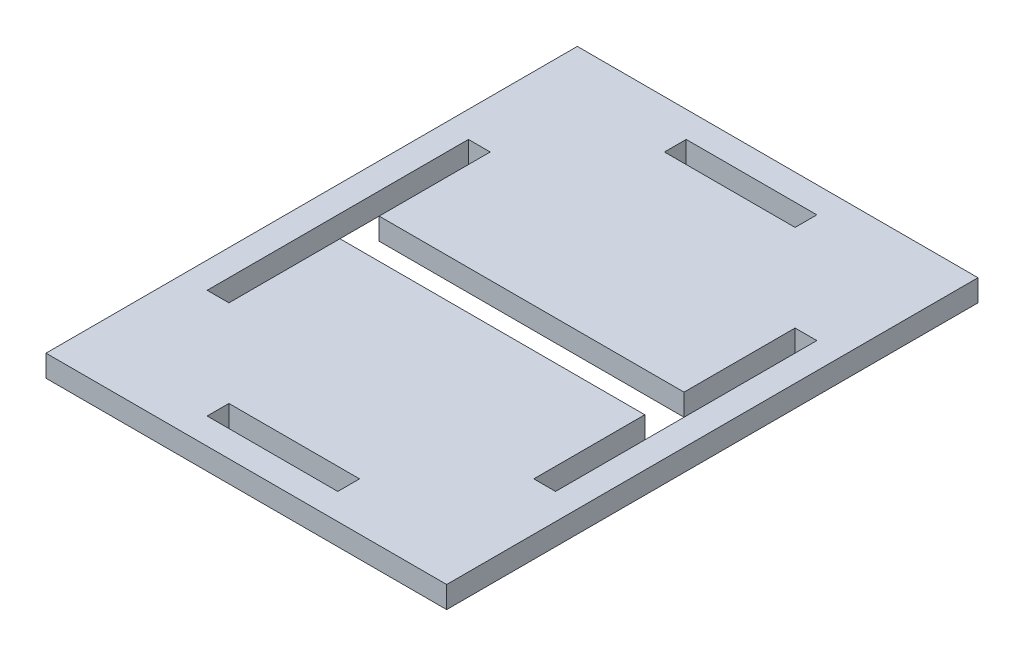
ISO-10303-21;
HEADER;
FILE_DESCRIPTION(('STEP AP214'),'2;1');
FILE_NAME('part.step','',(''),(''),'','','');
FILE_SCHEMA(('AUTOMOTIVE_DESIGN { 1 0 10303 214 1 1 1 1 }'));
ENDSEC;
DATA;
#1=APPLICATION_CONTEXT('core data for automotive mechanical design processes');
#2=APPLICATION_PROTOCOL_DEFINITION('international standard','automotive_design',2000,#1);
#3=PRODUCT_CONTEXT('',#1,'mechanical');
#4=PRODUCT('Part','Part','',(#3));
#5=PRODUCT_RELATED_PRODUCT_CATEGORY('part','',(#4));
#6=PRODUCT_DEFINITION_FORMATION('','',#4);
#7=PRODUCT_DEFINITION_CONTEXT('part definition',#1,'design');
#8=PRODUCT_DEFINITION('design','',#6,#7);
#9=PRODUCT_DEFINITION_SHAPE('','',#8);
#10=(LENGTH_UNIT() NAMED_UNIT(*) SI_UNIT(.MILLI.,.METRE.));
#11=(NAMED_UNIT(*) PLANE_ANGLE_UNIT() SI_UNIT($,.RADIAN.));
#12=(NAMED_UNIT(*) SI_UNIT($,.STERADIAN.) SOLID_ANGLE_UNIT());
#13=UNCERTAINTY_MEASURE_WITH_UNIT(LENGTH_MEASURE(1.E-05),#10,'distance_accuracy_value','');
#14=(GEOMETRIC_REPRESENTATION_CONTEXT(3) GLOBAL_UNCERTAINTY_ASSIGNED_CONTEXT((#13)) GLOBAL_UNIT_ASSIGNED_CONTEXT((#10,
#11,#12)) REPRESENTATION_CONTEXT('',''));
#15=CARTESIAN_POINT('',(0.,0.,0.));
#16=DIRECTION('',(0.,0.,1.));
#17=DIRECTION('',(1.,0.,0.));
#18=AXIS2_PLACEMENT_3D('',#15,#16,#17);
#19=CARTESIAN_POINT('',(35.,0.,-30.));
#20=DIRECTION('',(-1.,0.,0.));
#21=DIRECTION('',(0.,0.,1.));
#22=AXIS2_PLACEMENT_3D('',#19,#20,#21);
#23=PLANE('',#22);
#24=DIRECTION('',(0.,0.,1.));
#25=VECTOR('',#24,1.);
#26=CARTESIAN_POINT('',(35.,0.,-30.));
#27=LINE('',#26,#25);
#28=CARTESIAN_POINT('',(35.,0.,4.5));
#29=VERTEX_POINT('',#28);
#30=CARTESIAN_POINT('',(35.,0.,30.));
#31=VERTEX_POINT('',#30);
#32=EDGE_CURVE('E382',#29,#31,#27,.T.);
#33=ORIENTED_EDGE('',*,*,#32,.F.);
#34=DIRECTION('',(0.,1.,0.));
#35=VECTOR('',#34,1.);
#36=CARTESIAN_POINT('',(35.,-5.,4.5));
#37=LINE('',#36,#35);
#38=CARTESIAN_POINT('',(35.,5.,4.5));
#39=VERTEX_POINT('',#38);
#40=EDGE_CURVE('E198',#29,#39,#37,.T.);
#41=ORIENTED_EDGE('',*,*,#40,.T.);
#42=DIRECTION('',(0.,0.,1.));
#43=VECTOR('',#42,1.);
#44=CARTESIAN_POINT('',(35.,5.,-30.));
#45=LINE('',#44,#43);
#46=CARTESIAN_POINT('',(35.,5.,30.));
#47=VERTEX_POINT('',#46);
#48=EDGE_CURVE('E217',#39,#47,#45,.T.);
#49=ORIENTED_EDGE('',*,*,#48,.T.);
#50=DIRECTION('',(0.,1.,0.));
#51=VECTOR('',#50,1.);
#52=CARTESIAN_POINT('',(35.,0.,30.));
#53=LINE('',#52,#51);
#54=EDGE_CURVE('E229',#31,#47,#53,.T.);
#55=ORIENTED_EDGE('',*,*,#54,.F.);
#56=EDGE_LOOP('',(#33,#41,#49,#55));
#57=FACE_BOUND('',#56,.T.);
#58=ADVANCED_FACE('F33',(#57),#23,.F.);
#59=CARTESIAN_POINT('',(-35.,0.,-30.));
#60=DIRECTION('',(1.,0.,0.));
#61=DIRECTION('',(0.,0.,-1.));
#62=AXIS2_PLACEMENT_3D('',#59,#60,#61);
#63=PLANE('',#62);
#64=DIRECTION('',(0.,0.,-1.));
#65=VECTOR('',#64,1.);
#66=CARTESIAN_POINT('',(-35.,5.,-30.));
#67=LINE('',#66,#65);
#68=CARTESIAN_POINT('',(-35.,5.,30.));
#69=VERTEX_POINT('',#68);
#70=CARTESIAN_POINT('',(-35.,5.,4.5));
#71=VERTEX_POINT('',#70);
#72=EDGE_CURVE('E366',#69,#71,#67,.T.);
#73=ORIENTED_EDGE('',*,*,#72,.T.);
#74=DIRECTION('',(0.,-1.,0.));
#75=VECTOR('',#74,1.);
#76=CARTESIAN_POINT('',(-35.,0.,4.5));
#77=LINE('',#76,#75);
#78=CARTESIAN_POINT('',(-35.,0.,4.5));
#79=VERTEX_POINT('',#78);
#80=EDGE_CURVE('E11',#71,#79,#77,.T.);
#81=ORIENTED_EDGE('',*,*,#80,.T.);
#82=DIRECTION('',(0.,0.,-1.));
#83=VECTOR('',#82,1.);
#84=CARTESIAN_POINT('',(-35.,0.,-30.));
#85=LINE('',#84,#83);
#86=CARTESIAN_POINT('',(-35.,0.,30.));
#87=VERTEX_POINT('',#86);
#88=EDGE_CURVE('E357',#87,#79,#85,.T.);
#89=ORIENTED_EDGE('',*,*,#88,.F.);
#90=DIRECTION('',(0.,1.,0.));
#91=VECTOR('',#90,1.);
#92=CARTESIAN_POINT('',(-35.,0.,30.));
#93=LINE('',#92,#91);
#94=EDGE_CURVE('E374',#87,#69,#93,.T.);
#95=ORIENTED_EDGE('',*,*,#94,.T.);
#96=EDGE_LOOP('',(#73,#81,#89,#95));
#97=FACE_BOUND('',#96,.T.);
#98=ADVANCED_FACE('F403',(#97),#63,.F.);
#99=CARTESIAN_POINT('',(46.,5.,-61.));
#100=DIRECTION('',(-1.,0.,0.));
#101=DIRECTION('',(0.,0.,1.));
#102=AXIS2_PLACEMENT_3D('',#99,#100,#101);
#103=PLANE('',#102);
#104=DIRECTION('',(0.,0.,-1.));
#105=VECTOR('',#104,1.);
#106=CARTESIAN_POINT('',(46.,0.,-61.));
#107=LINE('',#106,#105);
#108=CARTESIAN_POINT('',(46.,0.,61.));
#109=VERTEX_POINT('',#108);
#110=CARTESIAN_POINT('',(46.,0.,-61.));
#111=VERTEX_POINT('',#110);
#112=EDGE_CURVE('E313',#109,#111,#107,.T.);
#113=ORIENTED_EDGE('',*,*,#112,.T.);
#114=DIRECTION('',(0.,-1.,0.));
#115=VECTOR('',#114,1.);
#116=CARTESIAN_POINT('',(46.,5.,-61.));
#117=LINE('',#116,#115);
#118=CARTESIAN_POINT('',(46.,5.,-61.));
#119=VERTEX_POINT('',#118);
#120=EDGE_CURVE('E330',#119,#111,#117,.T.);
#121=ORIENTED_EDGE('',*,*,#120,.F.);
#122=DIRECTION('',(0.,0.,-1.));
#123=VECTOR('',#122,1.);
#124=CARTESIAN_POINT('',(46.,5.,-61.));
#125=LINE('',#124,#123);
#126=CARTESIAN_POINT('',(46.,5.,61.));
#127=VERTEX_POINT('',#126);
#128=EDGE_CURVE('E302',#127,#119,#125,.T.);
#129=ORIENTED_EDGE('',*,*,#128,.F.);
#130=DIRECTION('',(0.,-1.,0.));
#131=VECTOR('',#130,1.);
#132=CARTESIAN_POINT('',(46.,5.,61.));
#133=LINE('',#132,#131);
#134=EDGE_CURVE('E312',#127,#109,#133,.T.);
#135=ORIENTED_EDGE('',*,*,#134,.T.);
#136=EDGE_LOOP('',(#113,#121,#129,#135));
#137=FACE_BOUND('',#136,.T.);
#138=ADVANCED_FACE('F35',(#137),#103,.F.);
#139=CARTESIAN_POINT('',(-46.,5.,-61.));
#140=DIRECTION('',(0.,0.,1.));
#141=DIRECTION('',(1.,0.,0.));
#142=AXIS2_PLACEMENT_3D('',#139,#140,#141);
#143=PLANE('',#142);
#144=DIRECTION('',(-1.,0.,0.));
#145=VECTOR('',#144,1.);
#146=CARTESIAN_POINT('',(-46.,0.,-61.));
#147=LINE('',#146,#145);
#148=CARTESIAN_POINT('',(-46.,0.,-61.));
#149=VERTEX_POINT('',#148);
#150=EDGE_CURVE('E316',#111,#149,#147,.T.);
#151=ORIENTED_EDGE('',*,*,#150,.T.);
#152=DIRECTION('',(0.,-1.,0.));
#153=VECTOR('',#152,1.);
#154=CARTESIAN_POINT('',(-46.,5.,-61.));
#155=LINE('',#154,#153);
#156=CARTESIAN_POINT('',(-46.,5.,-61.));
#157=VERTEX_POINT('',#156);
#158=EDGE_CURVE('E327',#157,#149,#155,.T.);
#159=ORIENTED_EDGE('',*,*,#158,.F.);
#160=DIRECTION('',(-1.,0.,0.));
#161=VECTOR('',#160,1.);
#162=CARTESIAN_POINT('',(-46.,5.,-61.));
#163=LINE('',#162,#161);
#164=EDGE_CURVE('E305',#119,#157,#163,.T.);
#165=ORIENTED_EDGE('',*,*,#164,.F.);
#166=ORIENTED_EDGE('',*,*,#120,.T.);
#167=EDGE_LOOP('',(#151,#159,#165,#166));
#168=FACE_BOUND('',#167,.T.);
#169=ADVANCED_FACE('F624',(#168),#143,.F.);
#170=CARTESIAN_POINT('',(-46.,5.,-61.));
#171=DIRECTION('',(1.,0.,0.));
#172=DIRECTION('',(0.,0.,-1.));
#173=AXIS2_PLACEMENT_3D('',#170,#171,#172);
#174=PLANE('',#173);
#175=DIRECTION('',(0.,0.,1.));
#176=VECTOR('',#175,1.);
#177=CARTESIAN_POINT('',(-46.,0.,-61.));
#178=LINE('',#177,#176);
#179=CARTESIAN_POINT('',(-46.,0.,61.));
#180=VERTEX_POINT('',#179);
#181=EDGE_CURVE('E319',#149,#180,#178,.T.);
#182=ORIENTED_EDGE('',*,*,#181,.T.);
#183=DIRECTION('',(0.,-1.,0.));
#184=VECTOR('',#183,1.);
#185=CARTESIAN_POINT('',(-46.,5.,61.));
#186=LINE('',#185,#184);
#187=CARTESIAN_POINT('',(-46.,5.,61.));
#188=VERTEX_POINT('',#187);
#189=EDGE_CURVE('E324',#188,#180,#186,.T.);
#190=ORIENTED_EDGE('',*,*,#189,.F.);
#191=DIRECTION('',(0.,0.,1.));
#192=VECTOR('',#191,1.);
#193=CARTESIAN_POINT('',(-46.,5.,-61.));
#194=LINE('',#193,#192);
#195=EDGE_CURVE('E308',#157,#188,#194,.T.);
#196=ORIENTED_EDGE('',*,*,#195,.F.);
#197=ORIENTED_EDGE('',*,*,#158,.T.);
#198=EDGE_LOOP('',(#182,#190,#196,#197));
#199=FACE_BOUND('',#198,.T.);
#200=ADVANCED_FACE('F614',(#199),#174,.F.);
#201=CARTESIAN_POINT('',(-46.,5.,61.));
#202=DIRECTION('',(0.,0.,-1.));
#203=DIRECTION('',(-1.,0.,0.));
#204=AXIS2_PLACEMENT_3D('',#201,#202,#203);
#205=PLANE('',#204);
#206=DIRECTION('',(1.,0.,0.));
#207=VECTOR('',#206,1.);
#208=CARTESIAN_POINT('',(-46.,0.,61.));
#209=LINE('',#208,#207);
#210=EDGE_CURVE('E306',#180,#109,#209,.T.);
#211=ORIENTED_EDGE('',*,*,#210,.T.);
#212=ORIENTED_EDGE('',*,*,#134,.F.);
#213=DIRECTION('',(1.,0.,0.));
#214=VECTOR('',#213,1.);
#215=CARTESIAN_POINT('',(-46.,5.,61.));
#216=LINE('',#215,#214);
#217=EDGE_CURVE('E310',#188,#127,#216,.T.);
#218=ORIENTED_EDGE('',*,*,#217,.F.);
#219=ORIENTED_EDGE('',*,*,#189,.T.);
#220=EDGE_LOOP('',(#211,#212,#218,#219));
#221=FACE_BOUND('',#220,.T.);
#222=ADVANCED_FACE('F493',(#221),#205,.F.);
#223=CARTESIAN_POINT('',(0.,5.,0.));
#224=DIRECTION('',(0.,1.,0.));
#225=DIRECTION('',(0.,0.,1.));
#226=AXIS2_PLACEMENT_3D('',#223,#224,#225);
#227=PLANE('',#226);
#228=DIRECTION('',(1.,0.,0.));
#229=VECTOR('',#228,1.);
#230=CARTESIAN_POINT('',(-35.,5.,4.5));
#231=LINE('',#230,#229);
#232=EDGE_CURVE('E199',#71,#39,#231,.T.);
#233=ORIENTED_EDGE('',*,*,#232,.F.);
#234=ORIENTED_EDGE('',*,*,#72,.F.);
#235=DIRECTION('',(1.,0.,0.));
#236=VECTOR('',#235,1.);
#237=CARTESIAN_POINT('',(-35.,5.,30.));
#238=LINE('',#237,#236);
#239=CARTESIAN_POINT('',(-40.,5.,30.));
#240=VERTEX_POINT('',#239);
#241=EDGE_CURVE('E363',#240,#69,#238,.T.);
#242=ORIENTED_EDGE('',*,*,#241,.F.);
#243=DIRECTION('',(0.,0.,1.));
#244=VECTOR('',#243,1.);
#245=CARTESIAN_POINT('',(-40.,5.,-30.));
#246=LINE('',#245,#244);
#247=CARTESIAN_POINT('',(-40.,5.,-30.));
#248=VERTEX_POINT('',#247);
#249=EDGE_CURVE('E228',#248,#240,#246,.T.);
#250=ORIENTED_EDGE('',*,*,#249,.F.);
#251=DIRECTION('',(-1.,0.,0.));
#252=VECTOR('',#251,1.);
#253=CARTESIAN_POINT('',(-35.,5.,-30.));
#254=LINE('',#253,#252);
#255=CARTESIAN_POINT('',(-35.,5.,-30.));
#256=VERTEX_POINT('',#255);
#257=EDGE_CURVE('E354',#256,#248,#254,.T.);
#258=ORIENTED_EDGE('',*,*,#257,.F.);
#259=CARTESIAN_POINT('',(-35.,5.,-4.5));
#260=VERTEX_POINT('',#259);
#261=EDGE_CURVE('E210',#260,#256,#67,.T.);
#262=ORIENTED_EDGE('',*,*,#261,.F.);
#263=DIRECTION('',(-1.,0.,0.));
#264=VECTOR('',#263,1.);
#265=CARTESIAN_POINT('',(-35.,5.,-4.5));
#266=LINE('',#265,#264);
#267=CARTESIAN_POINT('',(35.,5.,-4.5));
#268=VERTEX_POINT('',#267);
#269=EDGE_CURVE('E55',#268,#260,#266,.T.);
#270=ORIENTED_EDGE('',*,*,#269,.F.);
#271=CARTESIAN_POINT('',(35.,5.,-30.));
#272=VERTEX_POINT('',#271);
#273=EDGE_CURVE('E208',#272,#268,#45,.T.);
#274=ORIENTED_EDGE('',*,*,#273,.F.);
#275=DIRECTION('',(-1.,0.,0.));
#276=VECTOR('',#275,1.);
#277=CARTESIAN_POINT('',(35.,5.,-30.));
#278=LINE('',#277,#276);
#279=CARTESIAN_POINT('',(40.,5.,-30.));
#280=VERTEX_POINT('',#279);
#281=EDGE_CURVE('E222',#280,#272,#278,.T.);
#282=ORIENTED_EDGE('',*,*,#281,.F.);
#283=DIRECTION('',(0.,0.,-1.));
#284=VECTOR('',#283,1.);
#285=CARTESIAN_POINT('',(40.,5.,-30.));
#286=LINE('',#285,#284);
#287=CARTESIAN_POINT('',(40.,5.,30.));
#288=VERTEX_POINT('',#287);
#289=EDGE_CURVE('E264',#288,#280,#286,.T.);
#290=ORIENTED_EDGE('',*,*,#289,.F.);
#291=DIRECTION('',(1.,0.,0.));
#292=VECTOR('',#291,1.);
#293=CARTESIAN_POINT('',(35.,5.,30.));
#294=LINE('',#293,#292);
#295=EDGE_CURVE('E216',#47,#288,#294,.T.);
#296=ORIENTED_EDGE('',*,*,#295,.F.);
#297=ORIENTED_EDGE('',*,*,#48,.F.);
#298=EDGE_LOOP('',(#233,#234,#242,#250,#258,#262,#270,#274,#282,#290,#296,#297));
#299=FACE_BOUND('',#298,.T.);
#300=DIRECTION('',(0.,0.,-1.));
#301=VECTOR('',#300,1.);
#302=CARTESIAN_POINT('',(15.,5.,-50.));
#303=LINE('',#302,#301);
#304=CARTESIAN_POINT('',(15.,5.,-50.));
#305=VERTEX_POINT('',#304);
#306=CARTESIAN_POINT('',(15.,5.,-55.));
#307=VERTEX_POINT('',#306);
#308=EDGE_CURVE('E251',#305,#307,#303,.T.);
#309=ORIENTED_EDGE('',*,*,#308,.F.);
#310=DIRECTION('',(1.,0.,0.));
#311=VECTOR('',#310,1.);
#312=CARTESIAN_POINT('',(-15.,5.,-50.));
#313=LINE('',#312,#311);
#314=CARTESIAN_POINT('',(-15.,5.,-50.));
#315=VERTEX_POINT('',#314);
#316=EDGE_CURVE('E241',#315,#305,#313,.T.);
#317=ORIENTED_EDGE('',*,*,#316,.F.);
#318=DIRECTION('',(0.,0.,1.));
#319=VECTOR('',#318,1.);
#320=CARTESIAN_POINT('',(-15.,5.,-50.));
#321=LINE('',#320,#319);
#322=CARTESIAN_POINT('',(-15.,5.,-55.));
#323=VERTEX_POINT('',#322);
#324=EDGE_CURVE('E257',#323,#315,#321,.T.);
#325=ORIENTED_EDGE('',*,*,#324,.F.);
#326=DIRECTION('',(-1.,0.,0.));
#327=VECTOR('',#326,1.);
#328=CARTESIAN_POINT('',(-15.,5.,-55.));
#329=LINE('',#328,#327);
#330=EDGE_CURVE('E253',#307,#323,#329,.T.);
#331=ORIENTED_EDGE('',*,*,#330,.F.);
#332=EDGE_LOOP('',(#309,#317,#325,#331));
#333=FACE_BOUND('',#332,.T.);
#334=DIRECTION('',(0.,0.,-1.));
#335=VECTOR('',#334,1.);
#336=CARTESIAN_POINT('',(15.,5.,50.));
#337=LINE('',#336,#335);
#338=CARTESIAN_POINT('',(15.,5.,55.));
#339=VERTEX_POINT('',#338);
#340=CARTESIAN_POINT('',(15.,5.,50.));
#341=VERTEX_POINT('',#340);
#342=EDGE_CURVE('E285',#339,#341,#337,.T.);
#343=ORIENTED_EDGE('',*,*,#342,.F.);
#344=DIRECTION('',(1.,0.,0.));
#345=VECTOR('',#344,1.);
#346=CARTESIAN_POINT('',(-15.,5.,55.));
#347=LINE('',#346,#345);
#348=CARTESIAN_POINT('',(-15.,5.,55.));
#349=VERTEX_POINT('',#348);
#350=EDGE_CURVE('E275',#349,#339,#347,.T.);
#351=ORIENTED_EDGE('',*,*,#350,.F.);
#352=DIRECTION('',(0.,0.,1.));
#353=VECTOR('',#352,1.);
#354=CARTESIAN_POINT('',(-15.,5.,50.));
#355=LINE('',#354,#353);
#356=CARTESIAN_POINT('',(-15.,5.,50.));
#357=VERTEX_POINT('',#356);
#358=EDGE_CURVE('E290',#357,#349,#355,.T.);
#359=ORIENTED_EDGE('',*,*,#358,.F.);
#360=DIRECTION('',(-1.,0.,0.));
#361=VECTOR('',#360,1.);
#362=CARTESIAN_POINT('',(-15.,5.,50.));
#363=LINE('',#362,#361);
#364=EDGE_CURVE('E287',#341,#357,#363,.T.);
#365=ORIENTED_EDGE('',*,*,#364,.F.);
#366=EDGE_LOOP('',(#343,#351,#359,#365));
#367=FACE_BOUND('',#366,.T.);
#368=ORIENTED_EDGE('',*,*,#128,.T.);
#369=ORIENTED_EDGE('',*,*,#164,.T.);
#370=ORIENTED_EDGE('',*,*,#195,.T.);
#371=ORIENTED_EDGE('',*,*,#217,.T.);
#372=EDGE_LOOP('',(#368,#369,#370,#371));
#373=FACE_BOUND('',#372,.T.);
#374=ADVANCED_FACE('F205',(#299,#333,#367,#373),#227,.T.);
#375=CARTESIAN_POINT('',(0.,0.,0.));
#376=DIRECTION('',(0.,1.,0.));
#377=DIRECTION('',(0.,0.,1.));
#378=AXIS2_PLACEMENT_3D('',#375,#376,#377);
#379=PLANE('',#378);
#380=ORIENTED_EDGE('',*,*,#88,.T.);
#381=DIRECTION('',(1.,0.,0.));
#382=VECTOR('',#381,1.);
#383=CARTESIAN_POINT('',(0.,0.,4.5));
#384=LINE('',#383,#382);
#385=EDGE_CURVE('E48',#79,#29,#384,.T.);
#386=ORIENTED_EDGE('',*,*,#385,.T.);
#387=ORIENTED_EDGE('',*,*,#32,.T.);
#388=DIRECTION('',(1.,0.,0.));
#389=VECTOR('',#388,1.);
#390=CARTESIAN_POINT('',(35.,0.,30.));
#391=LINE('',#390,#389);
#392=CARTESIAN_POINT('',(40.,0.,30.));
#393=VERTEX_POINT('',#392);
#394=EDGE_CURVE('E236',#31,#393,#391,.T.);
#395=ORIENTED_EDGE('',*,*,#394,.T.);
#396=DIRECTION('',(0.,0.,-1.));
#397=VECTOR('',#396,1.);
#398=CARTESIAN_POINT('',(40.,0.,-30.));
#399=LINE('',#398,#397);
#400=CARTESIAN_POINT('',(40.,0.,-30.));
#401=VERTEX_POINT('',#400);
#402=EDGE_CURVE('E220',#393,#401,#399,.T.);
#403=ORIENTED_EDGE('',*,*,#402,.T.);
#404=DIRECTION('',(-1.,0.,0.));
#405=VECTOR('',#404,1.);
#406=CARTESIAN_POINT('',(35.,0.,-30.));
#407=LINE('',#406,#405);
#408=CARTESIAN_POINT('',(35.,0.,-30.));
#409=VERTEX_POINT('',#408);
#410=EDGE_CURVE('E380',#401,#409,#407,.T.);
#411=ORIENTED_EDGE('',*,*,#410,.T.);
#412=CARTESIAN_POINT('',(35.,0.,-4.5));
#413=VERTEX_POINT('',#412);
#414=EDGE_CURVE('E344',#409,#413,#27,.T.);
#415=ORIENTED_EDGE('',*,*,#414,.T.);
#416=DIRECTION('',(-1.,0.,0.));
#417=VECTOR('',#416,1.);
#418=CARTESIAN_POINT('',(0.,0.,-4.5));
#419=LINE('',#418,#417);
#420=CARTESIAN_POINT('',(-35.,0.,-4.5));
#421=VERTEX_POINT('',#420);
#422=EDGE_CURVE('E194',#413,#421,#419,.T.);
#423=ORIENTED_EDGE('',*,*,#422,.T.);
#424=CARTESIAN_POINT('',(-35.,0.,-30.));
#425=VERTEX_POINT('',#424);
#426=EDGE_CURVE('E337',#421,#425,#85,.T.);
#427=ORIENTED_EDGE('',*,*,#426,.T.);
#428=DIRECTION('',(-1.,0.,0.));
#429=VECTOR('',#428,1.);
#430=CARTESIAN_POINT('',(-35.,0.,-30.));
#431=LINE('',#430,#429);
#432=CARTESIAN_POINT('',(-40.,0.,-30.));
#433=VERTEX_POINT('',#432);
#434=EDGE_CURVE('E359',#425,#433,#431,.T.);
#435=ORIENTED_EDGE('',*,*,#434,.T.);
#436=DIRECTION('',(0.,0.,1.));
#437=VECTOR('',#436,1.);
#438=CARTESIAN_POINT('',(-40.,0.,-30.));
#439=LINE('',#438,#437);
#440=CARTESIAN_POINT('',(-40.,0.,30.));
#441=VERTEX_POINT('',#440);
#442=EDGE_CURVE('E350',#433,#441,#439,.T.);
#443=ORIENTED_EDGE('',*,*,#442,.T.);
#444=DIRECTION('',(1.,0.,0.));
#445=VECTOR('',#444,1.);
#446=CARTESIAN_POINT('',(-35.,0.,30.));
#447=LINE('',#446,#445);
#448=EDGE_CURVE('E353',#441,#87,#447,.T.);
#449=ORIENTED_EDGE('',*,*,#448,.T.);
#450=EDGE_LOOP('',(#380,#386,#387,#395,#403,#411,#415,#423,#427,#435,#443,#449));
#451=FACE_BOUND('',#450,.T.);
#452=DIRECTION('',(1.,0.,0.));
#453=VECTOR('',#452,1.);
#454=CARTESIAN_POINT('',(-15.,0.,-50.));
#455=LINE('',#454,#453);
#456=CARTESIAN_POINT('',(-15.,0.,-50.));
#457=VERTEX_POINT('',#456);
#458=CARTESIAN_POINT('',(15.,0.,-50.));
#459=VERTEX_POINT('',#458);
#460=EDGE_CURVE('E247',#457,#459,#455,.T.);
#461=ORIENTED_EDGE('',*,*,#460,.T.);
#462=DIRECTION('',(0.,0.,-1.));
#463=VECTOR('',#462,1.);
#464=CARTESIAN_POINT('',(15.,0.,-50.));
#465=LINE('',#464,#463);
#466=CARTESIAN_POINT('',(15.,0.,-55.));
#467=VERTEX_POINT('',#466);
#468=EDGE_CURVE('E237',#459,#467,#465,.T.);
#469=ORIENTED_EDGE('',*,*,#468,.T.);
#470=DIRECTION('',(-1.,0.,0.));
#471=VECTOR('',#470,1.);
#472=CARTESIAN_POINT('',(-15.,0.,-55.));
#473=LINE('',#472,#471);
#474=CARTESIAN_POINT('',(-15.,0.,-55.));
#475=VERTEX_POINT('',#474);
#476=EDGE_CURVE('E240',#467,#475,#473,.T.);
#477=ORIENTED_EDGE('',*,*,#476,.T.);
#478=DIRECTION('',(0.,0.,1.));
#479=VECTOR('',#478,1.);
#480=CARTESIAN_POINT('',(-15.,0.,-50.));
#481=LINE('',#480,#479);
#482=EDGE_CURVE('E244',#475,#457,#481,.T.);
#483=ORIENTED_EDGE('',*,*,#482,.T.);
#484=EDGE_LOOP('',(#461,#469,#477,#483));
#485=FACE_BOUND('',#484,.T.);
#486=DIRECTION('',(1.,0.,0.));
#487=VECTOR('',#486,1.);
#488=CARTESIAN_POINT('',(-15.,0.,55.));
#489=LINE('',#488,#487);
#490=CARTESIAN_POINT('',(-15.,0.,55.));
#491=VERTEX_POINT('',#490);
#492=CARTESIAN_POINT('',(15.,0.,55.));
#493=VERTEX_POINT('',#492);
#494=EDGE_CURVE('E281',#491,#493,#489,.T.);
#495=ORIENTED_EDGE('',*,*,#494,.T.);
#496=DIRECTION('',(0.,0.,-1.));
#497=VECTOR('',#496,1.);
#498=CARTESIAN_POINT('',(15.,0.,50.));
#499=LINE('',#498,#497);
#500=CARTESIAN_POINT('',(15.,0.,50.));
#501=VERTEX_POINT('',#500);
#502=EDGE_CURVE('E271',#493,#501,#499,.T.);
#503=ORIENTED_EDGE('',*,*,#502,.T.);
#504=DIRECTION('',(-1.,0.,0.));
#505=VECTOR('',#504,1.);
#506=CARTESIAN_POINT('',(-15.,0.,50.));
#507=LINE('',#506,#505);
#508=CARTESIAN_POINT('',(-15.,0.,50.));
#509=VERTEX_POINT('',#508);
#510=EDGE_CURVE('E274',#501,#509,#507,.T.);
#511=ORIENTED_EDGE('',*,*,#510,.T.);
#512=DIRECTION('',(0.,0.,1.));
#513=VECTOR('',#512,1.);
#514=CARTESIAN_POINT('',(-15.,0.,50.));
#515=LINE('',#514,#513);
#516=EDGE_CURVE('E278',#509,#491,#515,.T.);
#517=ORIENTED_EDGE('',*,*,#516,.T.);
#518=EDGE_LOOP('',(#495,#503,#511,#517));
#519=FACE_BOUND('',#518,.T.);
#520=ORIENTED_EDGE('',*,*,#112,.F.);
#521=ORIENTED_EDGE('',*,*,#210,.F.);
#522=ORIENTED_EDGE('',*,*,#181,.F.);
#523=ORIENTED_EDGE('',*,*,#150,.F.);
#524=EDGE_LOOP('',(#520,#521,#522,#523));
#525=FACE_BOUND('',#524,.T.);
#526=ADVANCED_FACE('F340',(#451,#485,#519,#525),#379,.F.);
#527=CARTESIAN_POINT('',(15.,0.,50.));
#528=DIRECTION('',(1.,0.,0.));
#529=DIRECTION('',(0.,0.,-1.));
#530=AXIS2_PLACEMENT_3D('',#527,#528,#529);
#531=PLANE('',#530);
#532=ORIENTED_EDGE('',*,*,#342,.T.);
#533=DIRECTION('',(0.,1.,0.));
#534=VECTOR('',#533,1.);
#535=CARTESIAN_POINT('',(15.,0.,50.));
#536=LINE('',#535,#534);
#537=EDGE_CURVE('E284',#501,#341,#536,.T.);
#538=ORIENTED_EDGE('',*,*,#537,.F.);
#539=ORIENTED_EDGE('',*,*,#502,.F.);
#540=DIRECTION('',(0.,1.,0.));
#541=VECTOR('',#540,1.);
#542=CARTESIAN_POINT('',(15.,0.,55.));
#543=LINE('',#542,#541);
#544=EDGE_CURVE('E254',#493,#339,#543,.T.);
#545=ORIENTED_EDGE('',*,*,#544,.T.);
#546=EDGE_LOOP('',(#532,#538,#539,#545));
#547=FACE_BOUND('',#546,.T.);
#548=ADVANCED_FACE('F482',(#547),#531,.F.);
#549=CARTESIAN_POINT('',(-15.,0.,55.));
#550=DIRECTION('',(0.,0.,1.));
#551=DIRECTION('',(1.,0.,0.));
#552=AXIS2_PLACEMENT_3D('',#549,#550,#551);
#553=PLANE('',#552);
#554=ORIENTED_EDGE('',*,*,#350,.T.);
#555=ORIENTED_EDGE('',*,*,#544,.F.);
#556=ORIENTED_EDGE('',*,*,#494,.F.);
#557=DIRECTION('',(0.,1.,0.));
#558=VECTOR('',#557,1.);
#559=CARTESIAN_POINT('',(-15.,0.,55.));
#560=LINE('',#559,#558);
#561=EDGE_CURVE('E296',#491,#349,#560,.T.);
#562=ORIENTED_EDGE('',*,*,#561,.T.);
#563=EDGE_LOOP('',(#554,#555,#556,#562));
#564=FACE_BOUND('',#563,.T.);
#565=ADVANCED_FACE('F590',(#564),#553,.F.);
#566=CARTESIAN_POINT('',(-15.,0.,50.));
#567=DIRECTION('',(-1.,0.,0.));
#568=DIRECTION('',(0.,0.,1.));
#569=AXIS2_PLACEMENT_3D('',#566,#567,#568);
#570=PLANE('',#569);
#571=ORIENTED_EDGE('',*,*,#358,.T.);
#572=ORIENTED_EDGE('',*,*,#561,.F.);
#573=ORIENTED_EDGE('',*,*,#516,.F.);
#574=DIRECTION('',(0.,1.,0.));
#575=VECTOR('',#574,1.);
#576=CARTESIAN_POINT('',(-15.,0.,50.));
#577=LINE('',#576,#575);
#578=EDGE_CURVE('E298',#509,#357,#577,.T.);
#579=ORIENTED_EDGE('',*,*,#578,.T.);
#580=EDGE_LOOP('',(#571,#572,#573,#579));
#581=FACE_BOUND('',#580,.T.);
#582=ADVANCED_FACE('F580',(#581),#570,.F.);
#583=CARTESIAN_POINT('',(-15.,0.,50.));
#584=DIRECTION('',(0.,0.,-1.));
#585=DIRECTION('',(-1.,0.,0.));
#586=AXIS2_PLACEMENT_3D('',#583,#584,#585);
#587=PLANE('',#586);
#588=ORIENTED_EDGE('',*,*,#364,.T.);
#589=ORIENTED_EDGE('',*,*,#578,.F.);
#590=ORIENTED_EDGE('',*,*,#510,.F.);
#591=ORIENTED_EDGE('',*,*,#537,.T.);
#592=EDGE_LOOP('',(#588,#589,#590,#591));
#593=FACE_BOUND('',#592,.T.);
#594=ADVANCED_FACE('F570',(#593),#587,.F.);
#595=CARTESIAN_POINT('',(15.,0.,-50.));
#596=DIRECTION('',(1.,0.,0.));
#597=DIRECTION('',(0.,0.,-1.));
#598=AXIS2_PLACEMENT_3D('',#595,#596,#597);
#599=PLANE('',#598);
#600=ORIENTED_EDGE('',*,*,#308,.T.);
#601=DIRECTION('',(0.,1.,0.));
#602=VECTOR('',#601,1.);
#603=CARTESIAN_POINT('',(15.,0.,-55.));
#604=LINE('',#603,#602);
#605=EDGE_CURVE('E250',#467,#307,#604,.T.);
#606=ORIENTED_EDGE('',*,*,#605,.F.);
#607=ORIENTED_EDGE('',*,*,#468,.F.);
#608=DIRECTION('',(0.,1.,0.));
#609=VECTOR('',#608,1.);
#610=CARTESIAN_POINT('',(15.,0.,-50.));
#611=LINE('',#610,#609);
#612=EDGE_CURVE('E262',#459,#305,#611,.T.);
#613=ORIENTED_EDGE('',*,*,#612,.T.);
#614=EDGE_LOOP('',(#600,#606,#607,#613));
#615=FACE_BOUND('',#614,.T.);
#616=ADVANCED_FACE('F560',(#615),#599,.F.);
#617=CARTESIAN_POINT('',(-15.,0.,-50.));
#618=DIRECTION('',(0.,0.,1.));
#619=DIRECTION('',(1.,0.,0.));
#620=AXIS2_PLACEMENT_3D('',#617,#618,#619);
#621=PLANE('',#620);
#622=ORIENTED_EDGE('',*,*,#316,.T.);
#623=ORIENTED_EDGE('',*,*,#612,.F.);
#624=ORIENTED_EDGE('',*,*,#460,.F.);
#625=DIRECTION('',(0.,1.,0.));
#626=VECTOR('',#625,1.);
#627=CARTESIAN_POINT('',(-15.,0.,-50.));
#628=LINE('',#627,#626);
#629=EDGE_CURVE('E265',#457,#315,#628,.T.);
#630=ORIENTED_EDGE('',*,*,#629,.T.);
#631=EDGE_LOOP('',(#622,#623,#624,#630));
#632=FACE_BOUND('',#631,.T.);
#633=ADVANCED_FACE('F550',(#632),#621,.F.);
#634=CARTESIAN_POINT('',(-15.,0.,-50.));
#635=DIRECTION('',(-1.,0.,0.));
#636=DIRECTION('',(0.,0.,1.));
#637=AXIS2_PLACEMENT_3D('',#634,#635,#636);
#638=PLANE('',#637);
#639=ORIENTED_EDGE('',*,*,#324,.T.);
#640=ORIENTED_EDGE('',*,*,#629,.F.);
#641=ORIENTED_EDGE('',*,*,#482,.F.);
#642=DIRECTION('',(0.,1.,0.));
#643=VECTOR('',#642,1.);
#644=CARTESIAN_POINT('',(-15.,0.,-55.));
#645=LINE('',#644,#643);
#646=EDGE_CURVE('E267',#475,#323,#645,.T.);
#647=ORIENTED_EDGE('',*,*,#646,.T.);
#648=EDGE_LOOP('',(#639,#640,#641,#647));
#649=FACE_BOUND('',#648,.T.);
#650=ADVANCED_FACE('F540',(#649),#638,.F.);
#651=CARTESIAN_POINT('',(-15.,0.,-55.));
#652=DIRECTION('',(0.,0.,-1.));
#653=DIRECTION('',(-1.,0.,0.));
#654=AXIS2_PLACEMENT_3D('',#651,#652,#653);
#655=PLANE('',#654);
#656=ORIENTED_EDGE('',*,*,#330,.T.);
#657=ORIENTED_EDGE('',*,*,#646,.F.);
#658=ORIENTED_EDGE('',*,*,#476,.F.);
#659=ORIENTED_EDGE('',*,*,#605,.T.);
#660=EDGE_LOOP('',(#656,#657,#658,#659));
#661=FACE_BOUND('',#660,.T.);
#662=ADVANCED_FACE('F441',(#661),#655,.F.);
#663=CARTESIAN_POINT('',(40.,0.,-30.));
#664=DIRECTION('',(1.,0.,0.));
#665=DIRECTION('',(0.,0.,-1.));
#666=AXIS2_PLACEMENT_3D('',#663,#664,#665);
#667=PLANE('',#666);
#668=ORIENTED_EDGE('',*,*,#289,.T.);
#669=DIRECTION('',(0.,1.,0.));
#670=VECTOR('',#669,1.);
#671=CARTESIAN_POINT('',(40.,0.,-30.));
#672=LINE('',#671,#670);
#673=EDGE_CURVE('E233',#401,#280,#672,.T.);
#674=ORIENTED_EDGE('',*,*,#673,.F.);
#675=ORIENTED_EDGE('',*,*,#402,.F.);
#676=DIRECTION('',(0.,1.,0.));
#677=VECTOR('',#676,1.);
#678=CARTESIAN_POINT('',(40.,0.,30.));
#679=LINE('',#678,#677);
#680=EDGE_CURVE('E226',#393,#288,#679,.T.);
#681=ORIENTED_EDGE('',*,*,#680,.T.);
#682=EDGE_LOOP('',(#668,#674,#675,#681));
#683=FACE_BOUND('',#682,.T.);
#684=ADVANCED_FACE('F437',(#683),#667,.F.);
#685=CARTESIAN_POINT('',(35.,0.,30.));
#686=DIRECTION('',(0.,0.,1.));
#687=DIRECTION('',(1.,0.,0.));
#688=AXIS2_PLACEMENT_3D('',#685,#686,#687);
#689=PLANE('',#688);
#690=ORIENTED_EDGE('',*,*,#295,.T.);
#691=ORIENTED_EDGE('',*,*,#680,.F.);
#692=ORIENTED_EDGE('',*,*,#394,.F.);
#693=ORIENTED_EDGE('',*,*,#54,.T.);
#694=EDGE_LOOP('',(#690,#691,#692,#693));
#695=FACE_BOUND('',#694,.T.);
#696=ADVANCED_FACE('F393',(#695),#689,.F.);
#697=ORIENTED_EDGE('',*,*,#273,.T.);
#698=DIRECTION('',(0.,1.,0.));
#699=VECTOR('',#698,1.);
#700=CARTESIAN_POINT('',(35.,-5.,-4.5));
#701=LINE('',#700,#699);
#702=EDGE_CURVE('E191',#413,#268,#701,.T.);
#703=ORIENTED_EDGE('',*,*,#702,.F.);
#704=ORIENTED_EDGE('',*,*,#414,.F.);
#705=DIRECTION('',(0.,1.,0.));
#706=VECTOR('',#705,1.);
#707=CARTESIAN_POINT('',(35.,0.,-30.));
#708=LINE('',#707,#706);
#709=EDGE_CURVE('E214',#409,#272,#708,.T.);
#710=ORIENTED_EDGE('',*,*,#709,.T.);
#711=EDGE_LOOP('',(#697,#703,#704,#710));
#712=FACE_BOUND('',#711,.T.);
#713=ADVANCED_FACE('F212',(#712),#23,.F.);
#714=CARTESIAN_POINT('',(35.,0.,-30.));
#715=DIRECTION('',(0.,0.,-1.));
#716=DIRECTION('',(-1.,0.,0.));
#717=AXIS2_PLACEMENT_3D('',#714,#715,#716);
#718=PLANE('',#717);
#719=ORIENTED_EDGE('',*,*,#281,.T.);
#720=ORIENTED_EDGE('',*,*,#709,.F.);
#721=ORIENTED_EDGE('',*,*,#410,.F.);
#722=ORIENTED_EDGE('',*,*,#673,.T.);
#723=EDGE_LOOP('',(#719,#720,#721,#722));
#724=FACE_BOUND('',#723,.T.);
#725=ADVANCED_FACE('F388',(#724),#718,.F.);
#726=CARTESIAN_POINT('',(-40.,0.,-30.));
#727=DIRECTION('',(-1.,0.,0.));
#728=DIRECTION('',(0.,0.,1.));
#729=AXIS2_PLACEMENT_3D('',#726,#727,#728);
#730=PLANE('',#729);
#731=ORIENTED_EDGE('',*,*,#249,.T.);
#732=DIRECTION('',(0.,1.,0.));
#733=VECTOR('',#732,1.);
#734=CARTESIAN_POINT('',(-40.,0.,30.));
#735=LINE('',#734,#733);
#736=EDGE_CURVE('E361',#441,#240,#735,.T.);
#737=ORIENTED_EDGE('',*,*,#736,.F.);
#738=ORIENTED_EDGE('',*,*,#442,.F.);
#739=DIRECTION('',(0.,1.,0.));
#740=VECTOR('',#739,1.);
#741=CARTESIAN_POINT('',(-40.,0.,-30.));
#742=LINE('',#741,#740);
#743=EDGE_CURVE('E317',#433,#248,#742,.T.);
#744=ORIENTED_EDGE('',*,*,#743,.T.);
#745=EDGE_LOOP('',(#731,#737,#738,#744));
#746=FACE_BOUND('',#745,.T.);
#747=ADVANCED_FACE('F411',(#746),#730,.F.);
#748=CARTESIAN_POINT('',(-35.,0.,-30.));
#749=DIRECTION('',(0.,0.,-1.));
#750=DIRECTION('',(-1.,0.,0.));
#751=AXIS2_PLACEMENT_3D('',#748,#749,#750);
#752=PLANE('',#751);
#753=ORIENTED_EDGE('',*,*,#257,.T.);
#754=ORIENTED_EDGE('',*,*,#743,.F.);
#755=ORIENTED_EDGE('',*,*,#434,.F.);
#756=DIRECTION('',(0.,1.,0.));
#757=VECTOR('',#756,1.);
#758=CARTESIAN_POINT('',(-35.,0.,-30.));
#759=LINE('',#758,#757);
#760=EDGE_CURVE('E372',#425,#256,#759,.T.);
#761=ORIENTED_EDGE('',*,*,#760,.T.);
#762=EDGE_LOOP('',(#753,#754,#755,#761));
#763=FACE_BOUND('',#762,.T.);
#764=ADVANCED_FACE('F415',(#763),#752,.F.);
#765=ORIENTED_EDGE('',*,*,#426,.F.);
#766=DIRECTION('',(0.,1.,0.));
#767=VECTOR('',#766,1.);
#768=CARTESIAN_POINT('',(-35.,0.,-4.5));
#769=LINE('',#768,#767);
#770=EDGE_CURVE('E41',#421,#260,#769,.T.);
#771=ORIENTED_EDGE('',*,*,#770,.T.);
#772=ORIENTED_EDGE('',*,*,#261,.T.);
#773=ORIENTED_EDGE('',*,*,#760,.F.);
#774=EDGE_LOOP('',(#765,#771,#772,#773));
#775=FACE_BOUND('',#774,.T.);
#776=ADVANCED_FACE('F334',(#775),#63,.F.);
#777=CARTESIAN_POINT('',(-35.,0.,30.));
#778=DIRECTION('',(0.,0.,1.));
#779=DIRECTION('',(1.,0.,0.));
#780=AXIS2_PLACEMENT_3D('',#777,#778,#779);
#781=PLANE('',#780);
#782=ORIENTED_EDGE('',*,*,#241,.T.);
#783=ORIENTED_EDGE('',*,*,#94,.F.);
#784=ORIENTED_EDGE('',*,*,#448,.F.);
#785=ORIENTED_EDGE('',*,*,#736,.T.);
#786=EDGE_LOOP('',(#782,#783,#784,#785));
#787=FACE_BOUND('',#786,.T.);
#788=ADVANCED_FACE('F405',(#787),#781,.F.);
#789=CARTESIAN_POINT('',(-35.,-5.,-4.5));
#790=DIRECTION('',(0.,0.,-1.));
#791=DIRECTION('',(-1.,0.,0.));
#792=AXIS2_PLACEMENT_3D('',#789,#790,#791);
#793=PLANE('',#792);
#794=ORIENTED_EDGE('',*,*,#702,.T.);
#795=ORIENTED_EDGE('',*,*,#269,.T.);
#796=ORIENTED_EDGE('',*,*,#770,.F.);
#797=ORIENTED_EDGE('',*,*,#422,.F.);
#798=EDGE_LOOP('',(#794,#795,#796,#797));
#799=FACE_BOUND('',#798,.T.);
#800=ADVANCED_FACE('F192',(#799),#793,.F.);
#801=CARTESIAN_POINT('',(-35.,-5.,4.5));
#802=DIRECTION('',(0.,0.,1.));
#803=DIRECTION('',(1.,0.,0.));
#804=AXIS2_PLACEMENT_3D('',#801,#802,#803);
#805=PLANE('',#804);
#806=ORIENTED_EDGE('',*,*,#80,.F.);
#807=ORIENTED_EDGE('',*,*,#232,.T.);
#808=ORIENTED_EDGE('',*,*,#40,.F.);
#809=ORIENTED_EDGE('',*,*,#385,.F.);
#810=EDGE_LOOP('',(#806,#807,#808,#809));
#811=FACE_BOUND('',#810,.T.);
#812=ADVANCED_FACE('F399',(#811),#805,.F.);
#813=CLOSED_SHELL('',(#58,#98,#138,#169,#200,#222,#374,#526,#548,#565,#582,#594,#616,#633,#650,
#662,#684,#696,#713,#725,#747,#764,#776,#788,#800,#812));
#814=MANIFOLD_SOLID_BREP('B2',#813);
#815=ADVANCED_BREP_SHAPE_REPRESENTATION('',(#18,#814),#14);
#816=SHAPE_DEFINITION_REPRESENTATION(#9,#815);
ENDSEC;
END-ISO-10303-21;
